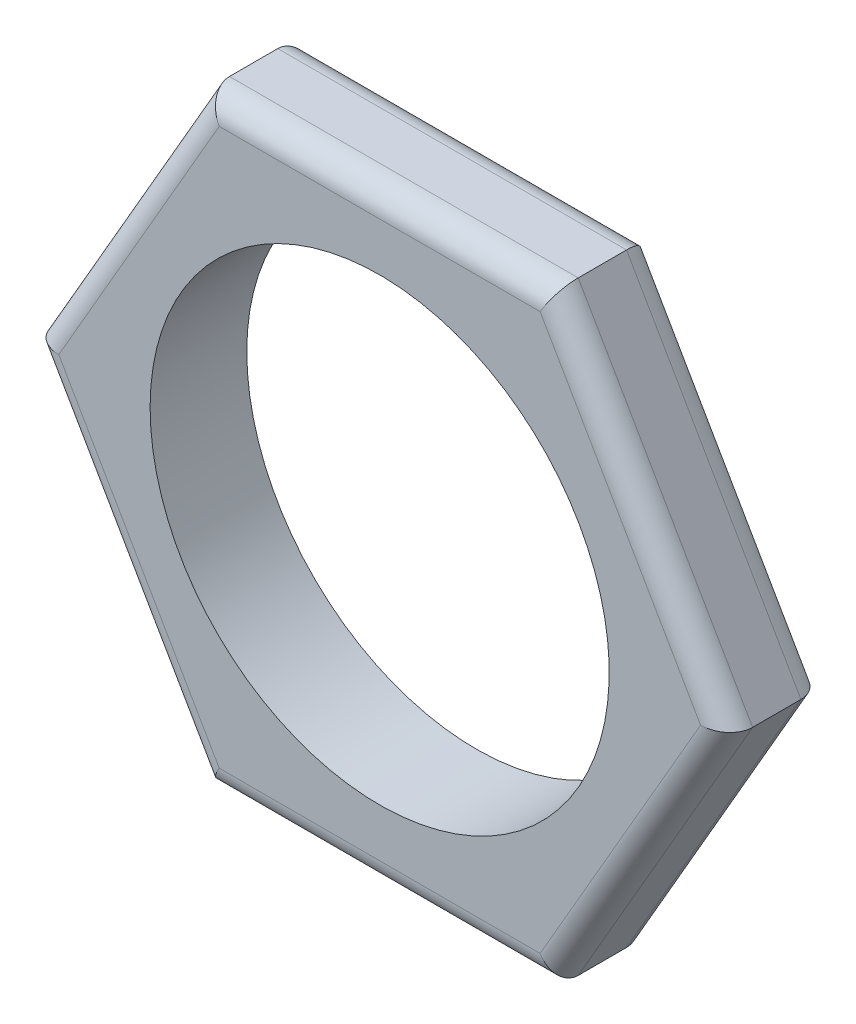
ISO-10303-21;
HEADER;
FILE_DESCRIPTION(('STEP AP214'),'2;1');
FILE_NAME('part.step','',(''),(''),'','','');
FILE_SCHEMA(('AUTOMOTIVE_DESIGN { 1 0 10303 214 1 1 1 1 }'));
ENDSEC;
DATA;
#1=APPLICATION_CONTEXT('core data for automotive mechanical design processes');
#2=APPLICATION_PROTOCOL_DEFINITION('international standard','automotive_design',2000,#1);
#3=PRODUCT_CONTEXT('',#1,'mechanical');
#4=PRODUCT('Part','Part','',(#3));
#5=PRODUCT_RELATED_PRODUCT_CATEGORY('part','',(#4));
#6=PRODUCT_DEFINITION_FORMATION('','',#4);
#7=PRODUCT_DEFINITION_CONTEXT('part definition',#1,'design');
#8=PRODUCT_DEFINITION('design','',#6,#7);
#9=PRODUCT_DEFINITION_SHAPE('','',#8);
#10=(LENGTH_UNIT() NAMED_UNIT(*) SI_UNIT(.MILLI.,.METRE.));
#11=(NAMED_UNIT(*) PLANE_ANGLE_UNIT() SI_UNIT($,.RADIAN.));
#12=(NAMED_UNIT(*) SI_UNIT($,.STERADIAN.) SOLID_ANGLE_UNIT());
#13=UNCERTAINTY_MEASURE_WITH_UNIT(LENGTH_MEASURE(1.E-05),#10,'distance_accuracy_value','');
#14=(GEOMETRIC_REPRESENTATION_CONTEXT(3) GLOBAL_UNCERTAINTY_ASSIGNED_CONTEXT((#13)) GLOBAL_UNIT_ASSIGNED_CONTEXT((#10,
#11,#12)) REPRESENTATION_CONTEXT('',''));
#15=CARTESIAN_POINT('',(0.,0.,0.));
#16=DIRECTION('',(0.,0.,1.));
#17=DIRECTION('',(1.,0.,0.));
#18=AXIS2_PLACEMENT_3D('',#15,#16,#17);
#19=CARTESIAN_POINT('',(-8.61550939198223,0.317499999999979,-0.635));
#20=DIRECTION('',(0.500000000000001,-0.866025403784438,0.));
#21=DIRECTION('',(0.866025403784438,0.500000000000001,0.));
#22=AXIS2_PLACEMENT_3D('',#19,#20,#21);
#23=CYLINDRICAL_SURFACE('',#22,0.635);
#24=CARTESIAN_POINT('',(-8.43220068151452,0.,-0.635));
#25=DIRECTION('',(0.,-1.,0.));
#26=DIRECTION('',(-1.,0.,0.));
#27=AXIS2_PLACEMENT_3D('',#24,#25,#26);
#28=ELLIPSE('',#27,0.733234841870825,0.635);
#29=CARTESIAN_POINT('',(-8.43220068151453,0.,-1.27));
#30=VERTEX_POINT('',#29);
#31=CARTESIAN_POINT('',(-9.16543552338535,0.,-0.635));
#32=VERTEX_POINT('',#31);
#33=EDGE_CURVE('E179',#30,#32,#28,.F.);
#34=ORIENTED_EDGE('',*,*,#33,.F.);
#35=DIRECTION('',(0.500000000000001,-0.866025403784438,0.));
#36=VECTOR('',#35,1.);
#37=CARTESIAN_POINT('',(-8.43220068151452,0.,-1.27));
#38=LINE('',#37,#36);
#39=CARTESIAN_POINT('',(-4.21610034075726,-7.30250000000004,-1.27));
#40=VERTEX_POINT('',#39);
#41=EDGE_CURVE('E107',#30,#40,#38,.T.);
#42=ORIENTED_EDGE('',*,*,#41,.T.);
#43=CARTESIAN_POINT('',(-4.21610034075726,-7.30250000000004,-0.635));
#44=DIRECTION('',(0.866025403784439,-0.499999999999999,0.));
#45=DIRECTION('',(0.499999999999999,0.866025403784439,0.));
#46=AXIS2_PLACEMENT_3D('',#43,#44,#45);
#47=ELLIPSE('',#46,0.733234841870825,0.635);
#48=CARTESIAN_POINT('',(-4.58271776169267,-7.93750000000004,-0.635));
#49=VERTEX_POINT('',#48);
#50=EDGE_CURVE('E19',#49,#40,#47,.T.);
#51=ORIENTED_EDGE('',*,*,#50,.F.);
#52=DIRECTION('',(-0.500000000000001,0.866025403784438,0.));
#53=VECTOR('',#52,1.);
#54=CARTESIAN_POINT('',(-9.16543552338535,0.,-0.635));
#55=LINE('',#54,#53);
#56=EDGE_CURVE('E104',#49,#32,#55,.T.);
#57=ORIENTED_EDGE('',*,*,#56,.T.);
#58=EDGE_LOOP('',(#34,#42,#51,#57));
#59=FACE_BOUND('',#58,.T.);
#60=ADVANCED_FACE('F16',(#59),#23,.T.);
#61=CARTESIAN_POINT('',(-4.58271776169267,-7.30250000000004,-0.635));
#62=DIRECTION('',(1.,0.,0.));
#63=DIRECTION('',(0.,0.,-1.));
#64=AXIS2_PLACEMENT_3D('',#61,#62,#63);
#65=CYLINDRICAL_SURFACE('',#64,0.635);
#66=CARTESIAN_POINT('',(4.21610034075723,-7.30250000000004,-0.635));
#67=DIRECTION('',(0.866025403784438,0.5,0.));
#68=DIRECTION('',(-0.5,0.866025403784438,0.));
#69=AXIS2_PLACEMENT_3D('',#66,#67,#68);
#70=ELLIPSE('',#69,0.733234841870825,0.635);
#71=CARTESIAN_POINT('',(4.58271776169264,-7.93750000000004,-0.635));
#72=VERTEX_POINT('',#71);
#73=CARTESIAN_POINT('',(4.21610034075723,-7.30250000000004,-1.27));
#74=VERTEX_POINT('',#73);
#75=EDGE_CURVE('E110',#72,#74,#70,.T.);
#76=ORIENTED_EDGE('',*,*,#75,.F.);
#77=DIRECTION('',(1.,0.,0.));
#78=VECTOR('',#77,1.);
#79=CARTESIAN_POINT('',(-4.58271776169267,-7.93750000000004,-0.635));
#80=LINE('',#79,#78);
#81=EDGE_CURVE('E112',#72,#49,#80,.F.);
#82=ORIENTED_EDGE('',*,*,#81,.T.);
#83=ORIENTED_EDGE('',*,*,#50,.T.);
#84=DIRECTION('',(1.,0.,0.));
#85=VECTOR('',#84,1.);
#86=CARTESIAN_POINT('',(0.,-7.30250000000004,-1.27));
#87=LINE('',#86,#85);
#88=EDGE_CURVE('E195',#40,#74,#87,.T.);
#89=ORIENTED_EDGE('',*,*,#88,.T.);
#90=EDGE_LOOP('',(#76,#82,#83,#89));
#91=FACE_BOUND('',#90,.T.);
#92=ADVANCED_FACE('F114',(#91),#65,.T.);
#93=CARTESIAN_POINT('',(4.03279163028952,-7.62000000000004,-0.635));
#94=DIRECTION('',(0.499999999999999,0.866025403784439,0.));
#95=DIRECTION('',(-0.866025403784439,0.499999999999999,0.));
#96=AXIS2_PLACEMENT_3D('',#93,#94,#95);
#97=CYLINDRICAL_SURFACE('',#96,0.635);
#98=CARTESIAN_POINT('',(8.43220068151448,0.,-0.635));
#99=DIRECTION('',(0.,1.,0.));
#100=DIRECTION('',(-1.,0.,0.));
#101=AXIS2_PLACEMENT_3D('',#98,#99,#100);
#102=ELLIPSE('',#101,0.733234841870824,0.635);
#103=CARTESIAN_POINT('',(9.16543552338531,0.,-0.635));
#104=VERTEX_POINT('',#103);
#105=CARTESIAN_POINT('',(8.43220068151448,0.,-1.27));
#106=VERTEX_POINT('',#105);
#107=EDGE_CURVE('E184',#104,#106,#102,.T.);
#108=ORIENTED_EDGE('',*,*,#107,.F.);
#109=DIRECTION('',(-0.499999999999999,-0.866025403784439,0.));
#110=VECTOR('',#109,1.);
#111=CARTESIAN_POINT('',(4.58271776169264,-7.93750000000004,-0.635));
#112=LINE('',#111,#110);
#113=EDGE_CURVE('E119',#104,#72,#112,.T.);
#114=ORIENTED_EDGE('',*,*,#113,.T.);
#115=ORIENTED_EDGE('',*,*,#75,.T.);
#116=DIRECTION('',(0.499999999999999,0.866025403784439,0.));
#117=VECTOR('',#116,1.);
#118=CARTESIAN_POINT('',(4.21610034075723,-7.30250000000004,-1.27));
#119=LINE('',#118,#117);
#120=EDGE_CURVE('E189',#74,#106,#119,.T.);
#121=ORIENTED_EDGE('',*,*,#120,.T.);
#122=EDGE_LOOP('',(#108,#114,#115,#121));
#123=FACE_BOUND('',#122,.T.);
#124=ADVANCED_FACE('F188',(#123),#97,.T.);
#125=CARTESIAN_POINT('',(8.61550939198219,-0.3175,-0.635));
#126=DIRECTION('',(-0.499999999999999,0.866025403784439,0.));
#127=DIRECTION('',(-0.866025403784439,-0.499999999999999,0.));
#128=AXIS2_PLACEMENT_3D('',#125,#126,#127);
#129=CYLINDRICAL_SURFACE('',#128,0.635);
#130=CARTESIAN_POINT('',(4.21610034075723,7.30250000000003,-0.635));
#131=DIRECTION('',(-0.866025403784438,0.5,0.));
#132=DIRECTION('',(-0.5,-0.866025403784438,0.));
#133=AXIS2_PLACEMENT_3D('',#130,#131,#132);
#134=ELLIPSE('',#133,0.733234841870825,0.635);
#135=CARTESIAN_POINT('',(4.58271776169264,7.93750000000003,-0.635));
#136=VERTEX_POINT('',#135);
#137=CARTESIAN_POINT('',(4.21610034075723,7.30250000000003,-1.27));
#138=VERTEX_POINT('',#137);
#139=EDGE_CURVE('E181',#136,#138,#134,.T.);
#140=ORIENTED_EDGE('',*,*,#139,.F.);
#141=DIRECTION('',(0.499999999999999,-0.866025403784439,0.));
#142=VECTOR('',#141,1.);
#143=CARTESIAN_POINT('',(9.16543552338531,0.,-0.635));
#144=LINE('',#143,#142);
#145=EDGE_CURVE('E147',#136,#104,#144,.T.);
#146=ORIENTED_EDGE('',*,*,#145,.T.);
#147=ORIENTED_EDGE('',*,*,#107,.T.);
#148=DIRECTION('',(-0.5,0.866025403784439,0.));
#149=VECTOR('',#148,1.);
#150=CARTESIAN_POINT('',(8.43220068151448,0.,-1.27));
#151=LINE('',#150,#149);
#152=EDGE_CURVE('E196',#106,#138,#151,.T.);
#153=ORIENTED_EDGE('',*,*,#152,.T.);
#154=EDGE_LOOP('',(#140,#146,#147,#153));
#155=FACE_BOUND('',#154,.T.);
#156=ADVANCED_FACE('F268',(#155),#129,.T.);
#157=CARTESIAN_POINT('',(4.58271776169264,7.30250000000003,-0.635));
#158=DIRECTION('',(-1.,0.,0.));
#159=DIRECTION('',(0.,0.,1.));
#160=AXIS2_PLACEMENT_3D('',#157,#158,#159);
#161=CYLINDRICAL_SURFACE('',#160,0.635);
#162=CARTESIAN_POINT('',(-4.21610034075725,7.30250000000003,-0.635));
#163=DIRECTION('',(-0.866025403784439,-0.5,0.));
#164=DIRECTION('',(0.5,-0.866025403784439,0.));
#165=AXIS2_PLACEMENT_3D('',#162,#163,#164);
#166=ELLIPSE('',#165,0.733234841870825,0.635);
#167=CARTESIAN_POINT('',(-4.58271776169266,7.93750000000003,-0.635));
#168=VERTEX_POINT('',#167);
#169=CARTESIAN_POINT('',(-4.21610034075725,7.30250000000003,-1.27));
#170=VERTEX_POINT('',#169);
#171=EDGE_CURVE('E120',#168,#170,#166,.T.);
#172=ORIENTED_EDGE('',*,*,#171,.F.);
#173=DIRECTION('',(1.,0.,0.));
#174=VECTOR('',#173,1.);
#175=CARTESIAN_POINT('',(4.58271776169264,7.93750000000003,-0.635));
#176=LINE('',#175,#174);
#177=EDGE_CURVE('E142',#168,#136,#176,.T.);
#178=ORIENTED_EDGE('',*,*,#177,.T.);
#179=ORIENTED_EDGE('',*,*,#139,.T.);
#180=DIRECTION('',(1.,0.,0.));
#181=VECTOR('',#180,1.);
#182=CARTESIAN_POINT('',(0.,7.30250000000003,-1.27));
#183=LINE('',#182,#181);
#184=EDGE_CURVE('E198',#138,#170,#183,.F.);
#185=ORIENTED_EDGE('',*,*,#184,.T.);
#186=EDGE_LOOP('',(#172,#178,#179,#185));
#187=FACE_BOUND('',#186,.T.);
#188=ADVANCED_FACE('F262',(#187),#161,.T.);
#189=CARTESIAN_POINT('',(-4.03279163028954,7.62000000000003,-0.635));
#190=DIRECTION('',(-0.5,-0.866025403784439,0.));
#191=DIRECTION('',(0.866025403784439,-0.5,0.));
#192=AXIS2_PLACEMENT_3D('',#189,#190,#191);
#193=CYLINDRICAL_SURFACE('',#192,0.635);
#194=ORIENTED_EDGE('',*,*,#171,.T.);
#195=DIRECTION('',(-0.5,-0.866025403784439,0.));
#196=VECTOR('',#195,1.);
#197=CARTESIAN_POINT('',(-4.21610034075725,7.30250000000003,-1.27));
#198=LINE('',#197,#196);
#199=EDGE_CURVE('E202',#170,#30,#198,.T.);
#200=ORIENTED_EDGE('',*,*,#199,.T.);
#201=ORIENTED_EDGE('',*,*,#33,.T.);
#202=DIRECTION('',(0.5,0.866025403784439,0.));
#203=VECTOR('',#202,1.);
#204=CARTESIAN_POINT('',(-4.58271776169266,7.93750000000003,-0.635));
#205=LINE('',#204,#203);
#206=EDGE_CURVE('E139',#32,#168,#205,.T.);
#207=ORIENTED_EDGE('',*,*,#206,.T.);
#208=EDGE_LOOP('',(#194,#200,#201,#207));
#209=FACE_BOUND('',#208,.T.);
#210=ADVANCED_FACE('F257',(#209),#193,.T.);
#211=CARTESIAN_POINT('',(-4.58271776169267,-7.93750000000004,1.27));
#212=DIRECTION('',(0.,1.,0.));
#213=DIRECTION('',(0.,0.,1.));
#214=AXIS2_PLACEMENT_3D('',#211,#212,#213);
#215=PLANE('',#214);
#216=ORIENTED_EDGE('',*,*,#81,.F.);
#217=DIRECTION('',(0.,0.,1.));
#218=VECTOR('',#217,1.);
#219=CARTESIAN_POINT('',(4.58271776169264,-7.93750000000004,1.27));
#220=LINE('',#219,#218);
#221=CARTESIAN_POINT('',(4.58271776169264,-7.93750000000004,0.635));
#222=VERTEX_POINT('',#221);
#223=EDGE_CURVE('E150',#72,#222,#220,.T.);
#224=ORIENTED_EDGE('',*,*,#223,.T.);
#225=DIRECTION('',(-1.,0.,0.));
#226=VECTOR('',#225,1.);
#227=CARTESIAN_POINT('',(0.,-7.93750000000004,0.635));
#228=LINE('',#227,#226);
#229=CARTESIAN_POINT('',(-4.58271776169267,-7.93750000000004,0.635));
#230=VERTEX_POINT('',#229);
#231=EDGE_CURVE('E127',#230,#222,#228,.F.);
#232=ORIENTED_EDGE('',*,*,#231,.F.);
#233=DIRECTION('',(0.,0.,1.));
#234=VECTOR('',#233,1.);
#235=CARTESIAN_POINT('',(-4.58271776169267,-7.93750000000004,1.27));
#236=LINE('',#235,#234);
#237=EDGE_CURVE('E124',#230,#49,#236,.F.);
#238=ORIENTED_EDGE('',*,*,#237,.T.);
#239=EDGE_LOOP('',(#216,#224,#232,#238));
#240=FACE_BOUND('',#239,.T.);
#241=ADVANCED_FACE('F125',(#240),#215,.F.);
#242=CARTESIAN_POINT('',(4.58271776169264,-7.93750000000004,1.27));
#243=DIRECTION('',(-0.866025403784439,0.499999999999999,0.));
#244=DIRECTION('',(-0.499999999999999,-0.866025403784439,0.));
#245=AXIS2_PLACEMENT_3D('',#242,#243,#244);
#246=PLANE('',#245);
#247=ORIENTED_EDGE('',*,*,#113,.F.);
#248=DIRECTION('',(0.,0.,1.));
#249=VECTOR('',#248,1.);
#250=CARTESIAN_POINT('',(9.16543552338531,0.,1.27));
#251=LINE('',#250,#249);
#252=CARTESIAN_POINT('',(9.16543552338531,0.,0.635));
#253=VERTEX_POINT('',#252);
#254=EDGE_CURVE('E146',#104,#253,#251,.T.);
#255=ORIENTED_EDGE('',*,*,#254,.T.);
#256=DIRECTION('',(-0.499999999999999,-0.866025403784439,0.));
#257=VECTOR('',#256,1.);
#258=CARTESIAN_POINT('',(6.87407664253899,-3.96874999999999,0.635));
#259=LINE('',#258,#257);
#260=EDGE_CURVE('E173',#222,#253,#259,.F.);
#261=ORIENTED_EDGE('',*,*,#260,.F.);
#262=ORIENTED_EDGE('',*,*,#223,.F.);
#263=EDGE_LOOP('',(#247,#255,#261,#262));
#264=FACE_BOUND('',#263,.T.);
#265=ADVANCED_FACE('F270',(#264),#246,.F.);
#266=CARTESIAN_POINT('',(9.16543552338531,0.,1.27));
#267=DIRECTION('',(-0.866025403784439,-0.499999999999999,0.));
#268=DIRECTION('',(0.499999999999999,-0.866025403784439,0.));
#269=AXIS2_PLACEMENT_3D('',#266,#267,#268);
#270=PLANE('',#269);
#271=ORIENTED_EDGE('',*,*,#145,.F.);
#272=DIRECTION('',(0.,0.,-1.));
#273=VECTOR('',#272,1.);
#274=CARTESIAN_POINT('',(4.58271776169264,7.93750000000003,1.27));
#275=LINE('',#274,#273);
#276=CARTESIAN_POINT('',(4.58271776169264,7.93750000000003,0.635));
#277=VERTEX_POINT('',#276);
#278=EDGE_CURVE('E145',#136,#277,#275,.F.);
#279=ORIENTED_EDGE('',*,*,#278,.T.);
#280=DIRECTION('',(0.499999999999999,-0.866025403784439,0.));
#281=VECTOR('',#280,1.);
#282=CARTESIAN_POINT('',(6.87407664253899,3.96875,0.635));
#283=LINE('',#282,#281);
#284=EDGE_CURVE('E169',#253,#277,#283,.F.);
#285=ORIENTED_EDGE('',*,*,#284,.F.);
#286=ORIENTED_EDGE('',*,*,#254,.F.);
#287=EDGE_LOOP('',(#271,#279,#285,#286));
#288=FACE_BOUND('',#287,.T.);
#289=ADVANCED_FACE('F265',(#288),#270,.F.);
#290=CARTESIAN_POINT('',(4.58271776169264,7.93750000000003,1.27));
#291=DIRECTION('',(0.,-1.,0.));
#292=DIRECTION('',(0.,0.,-1.));
#293=AXIS2_PLACEMENT_3D('',#290,#291,#292);
#294=PLANE('',#293);
#295=ORIENTED_EDGE('',*,*,#177,.F.);
#296=DIRECTION('',(0.,0.,1.));
#297=VECTOR('',#296,1.);
#298=CARTESIAN_POINT('',(-4.58271776169266,7.93750000000003,1.27));
#299=LINE('',#298,#297);
#300=CARTESIAN_POINT('',(-4.58271776169266,7.93750000000003,0.635));
#301=VERTEX_POINT('',#300);
#302=EDGE_CURVE('E131',#168,#301,#299,.T.);
#303=ORIENTED_EDGE('',*,*,#302,.T.);
#304=DIRECTION('',(1.,0.,0.));
#305=VECTOR('',#304,1.);
#306=CARTESIAN_POINT('',(0.,7.93750000000003,0.635));
#307=LINE('',#306,#305);
#308=EDGE_CURVE('E165',#277,#301,#307,.F.);
#309=ORIENTED_EDGE('',*,*,#308,.F.);
#310=ORIENTED_EDGE('',*,*,#278,.F.);
#311=EDGE_LOOP('',(#295,#303,#309,#310));
#312=FACE_BOUND('',#311,.T.);
#313=ADVANCED_FACE('F259',(#312),#294,.F.);
#314=CARTESIAN_POINT('',(-4.58271776169266,7.93750000000003,1.27));
#315=DIRECTION('',(0.866025403784439,-0.5,0.));
#316=DIRECTION('',(0.5,0.866025403784439,0.));
#317=AXIS2_PLACEMENT_3D('',#314,#315,#316);
#318=PLANE('',#317);
#319=ORIENTED_EDGE('',*,*,#206,.F.);
#320=DIRECTION('',(0.,0.,1.));
#321=VECTOR('',#320,1.);
#322=CARTESIAN_POINT('',(-9.16543552338535,0.,1.27));
#323=LINE('',#322,#321);
#324=CARTESIAN_POINT('',(-9.16543552338535,0.,0.635));
#325=VERTEX_POINT('',#324);
#326=EDGE_CURVE('E135',#32,#325,#323,.T.);
#327=ORIENTED_EDGE('',*,*,#326,.T.);
#328=DIRECTION('',(0.5,0.866025403784439,0.));
#329=VECTOR('',#328,1.);
#330=CARTESIAN_POINT('',(-6.874076642539,3.96875000000001,0.635));
#331=LINE('',#330,#329);
#332=EDGE_CURVE('E161',#301,#325,#331,.F.);
#333=ORIENTED_EDGE('',*,*,#332,.F.);
#334=ORIENTED_EDGE('',*,*,#302,.F.);
#335=EDGE_LOOP('',(#319,#327,#333,#334));
#336=FACE_BOUND('',#335,.T.);
#337=ADVANCED_FACE('F253',(#336),#318,.F.);
#338=CARTESIAN_POINT('',(-9.16543552338535,0.,1.27));
#339=DIRECTION('',(0.866025403784438,0.500000000000001,0.));
#340=DIRECTION('',(-0.500000000000001,0.866025403784438,0.));
#341=AXIS2_PLACEMENT_3D('',#338,#339,#340);
#342=PLANE('',#341);
#343=ORIENTED_EDGE('',*,*,#56,.F.);
#344=ORIENTED_EDGE('',*,*,#237,.F.);
#345=DIRECTION('',(-0.500000000000001,0.866025403784438,0.));
#346=VECTOR('',#345,1.);
#347=CARTESIAN_POINT('',(-6.87407664253901,-3.96875000000003,0.635));
#348=LINE('',#347,#346);
#349=EDGE_CURVE('E159',#325,#230,#348,.F.);
#350=ORIENTED_EDGE('',*,*,#349,.F.);
#351=ORIENTED_EDGE('',*,*,#326,.F.);
#352=EDGE_LOOP('',(#343,#344,#350,#351));
#353=FACE_BOUND('',#352,.T.);
#354=ADVANCED_FACE('F134',(#353),#342,.F.);
#355=CARTESIAN_POINT('',(0.,0.,-1.27));
#356=DIRECTION('',(0.,0.,1.));
#357=DIRECTION('',(1.,0.,0.));
#358=AXIS2_PLACEMENT_3D('',#355,#356,#357);
#359=PLANE('',#358);
#360=CARTESIAN_POINT('',(0.,0.,-1.27));
#361=DIRECTION('',(0.,0.,-1.));
#362=DIRECTION('',(-1.,0.,0.));
#363=AXIS2_PLACEMENT_3D('',#360,#361,#362);
#364=CIRCLE('',#363,6.0325);
#365=CARTESIAN_POINT('',(-6.0325,0.,-1.27));
#366=VERTEX_POINT('',#365);
#367=EDGE_CURVE('E152',#366,#366,#364,.F.);
#368=ORIENTED_EDGE('',*,*,#367,.T.);
#369=EDGE_LOOP('',(#368));
#370=FACE_BOUND('',#369,.T.);
#371=ORIENTED_EDGE('',*,*,#184,.F.);
#372=ORIENTED_EDGE('',*,*,#152,.F.);
#373=ORIENTED_EDGE('',*,*,#120,.F.);
#374=ORIENTED_EDGE('',*,*,#88,.F.);
#375=ORIENTED_EDGE('',*,*,#41,.F.);
#376=ORIENTED_EDGE('',*,*,#199,.F.);
#377=EDGE_LOOP('',(#371,#372,#373,#374,#375,#376));
#378=FACE_BOUND('',#377,.T.);
#379=ADVANCED_FACE('F194',(#370,#378),#359,.F.);
#380=CARTESIAN_POINT('',(0.,-7.30250000000004,0.635));
#381=DIRECTION('',(-1.,0.,0.));
#382=DIRECTION('',(0.,0.,1.));
#383=AXIS2_PLACEMENT_3D('',#380,#381,#382);
#384=CYLINDRICAL_SURFACE('',#383,0.635);
#385=CARTESIAN_POINT('',(4.21610034075723,-7.30250000000004,0.635));
#386=DIRECTION('',(-0.866025403784438,-0.5,0.));
#387=DIRECTION('',(0.5,-0.866025403784438,0.));
#388=AXIS2_PLACEMENT_3D('',#385,#386,#387);
#389=ELLIPSE('',#388,0.733234841870825,0.635);
#390=CARTESIAN_POINT('',(4.21610034075723,-7.30250000000004,1.27));
#391=VERTEX_POINT('',#390);
#392=EDGE_CURVE('E174',#391,#222,#389,.F.);
#393=ORIENTED_EDGE('',*,*,#392,.F.);
#394=DIRECTION('',(1.,0.,0.));
#395=VECTOR('',#394,1.);
#396=CARTESIAN_POINT('',(0.,-7.30250000000004,1.27));
#397=LINE('',#396,#395);
#398=CARTESIAN_POINT('',(-4.21610034075726,-7.30250000000004,1.27));
#399=VERTEX_POINT('',#398);
#400=EDGE_CURVE('E155',#399,#391,#397,.T.);
#401=ORIENTED_EDGE('',*,*,#400,.F.);
#402=CARTESIAN_POINT('',(-4.21610034075726,-7.30250000000004,0.635));
#403=DIRECTION('',(-0.866025403784439,0.499999999999999,0.));
#404=DIRECTION('',(0.499999999999999,0.866025403784439,0.));
#405=AXIS2_PLACEMENT_3D('',#402,#403,#404);
#406=ELLIPSE('',#405,0.733234841870825,0.635);
#407=EDGE_CURVE('E156',#230,#399,#406,.T.);
#408=ORIENTED_EDGE('',*,*,#407,.F.);
#409=ORIENTED_EDGE('',*,*,#231,.T.);
#410=EDGE_LOOP('',(#393,#401,#408,#409));
#411=FACE_BOUND('',#410,.T.);
#412=ADVANCED_FACE('F239',(#411),#384,.T.);
#413=CARTESIAN_POINT('',(6.32415051113587,-3.65124999999999,0.635));
#414=DIRECTION('',(-0.499999999999999,-0.866025403784439,0.));
#415=DIRECTION('',(0.866025403784439,-0.499999999999999,0.));
#416=AXIS2_PLACEMENT_3D('',#413,#414,#415);
#417=CYLINDRICAL_SURFACE('',#416,0.635);
#418=CARTESIAN_POINT('',(8.43220068151448,0.,0.635));
#419=DIRECTION('',(0.,-1.,0.));
#420=DIRECTION('',(1.,0.,0.));
#421=AXIS2_PLACEMENT_3D('',#418,#419,#420);
#422=ELLIPSE('',#421,0.733234841870824,0.635);
#423=CARTESIAN_POINT('',(8.43220068151448,0.,1.27));
#424=VERTEX_POINT('',#423);
#425=EDGE_CURVE('E170',#424,#253,#422,.F.);
#426=ORIENTED_EDGE('',*,*,#425,.F.);
#427=DIRECTION('',(0.499999999999999,0.866025403784439,0.));
#428=VECTOR('',#427,1.);
#429=CARTESIAN_POINT('',(4.21610034075723,-7.30250000000004,1.27));
#430=LINE('',#429,#428);
#431=EDGE_CURVE('E213',#391,#424,#430,.T.);
#432=ORIENTED_EDGE('',*,*,#431,.F.);
#433=ORIENTED_EDGE('',*,*,#392,.T.);
#434=ORIENTED_EDGE('',*,*,#260,.T.);
#435=EDGE_LOOP('',(#426,#432,#433,#434));
#436=FACE_BOUND('',#435,.T.);
#437=ADVANCED_FACE('F273',(#436),#417,.T.);
#438=CARTESIAN_POINT('',(6.32415051113587,3.65125,0.635));
#439=DIRECTION('',(0.499999999999999,-0.866025403784439,0.));
#440=DIRECTION('',(0.866025403784439,0.499999999999999,0.));
#441=AXIS2_PLACEMENT_3D('',#438,#439,#440);
#442=CYLINDRICAL_SURFACE('',#441,0.635);
#443=ORIENTED_EDGE('',*,*,#425,.T.);
#444=ORIENTED_EDGE('',*,*,#284,.T.);
#445=CARTESIAN_POINT('',(4.21610034075723,7.30250000000003,0.635));
#446=DIRECTION('',(0.866025403784438,-0.5,0.));
#447=DIRECTION('',(0.5,0.866025403784438,0.));
#448=AXIS2_PLACEMENT_3D('',#445,#446,#447);
#449=ELLIPSE('',#448,0.733234841870825,0.635);
#450=CARTESIAN_POINT('',(4.21610034075723,7.30250000000004,1.27));
#451=VERTEX_POINT('',#450);
#452=EDGE_CURVE('E166',#451,#277,#449,.F.);
#453=ORIENTED_EDGE('',*,*,#452,.F.);
#454=DIRECTION('',(-0.499999999999999,0.866025403784439,0.));
#455=VECTOR('',#454,1.);
#456=CARTESIAN_POINT('',(8.43220068151448,0.,1.27));
#457=LINE('',#456,#455);
#458=EDGE_CURVE('E216',#424,#451,#457,.T.);
#459=ORIENTED_EDGE('',*,*,#458,.F.);
#460=EDGE_LOOP('',(#443,#444,#453,#459));
#461=FACE_BOUND('',#460,.T.);
#462=ADVANCED_FACE('F276',(#461),#442,.T.);
#463=CARTESIAN_POINT('',(0.,7.30250000000003,0.635));
#464=DIRECTION('',(1.,0.,0.));
#465=DIRECTION('',(0.,0.,-1.));
#466=AXIS2_PLACEMENT_3D('',#463,#464,#465);
#467=CYLINDRICAL_SURFACE('',#466,0.635);
#468=ORIENTED_EDGE('',*,*,#452,.T.);
#469=ORIENTED_EDGE('',*,*,#308,.T.);
#470=CARTESIAN_POINT('',(-4.21610034075725,7.30250000000003,0.635));
#471=DIRECTION('',(0.866025403784439,0.5,0.));
#472=DIRECTION('',(-0.5,0.866025403784439,0.));
#473=AXIS2_PLACEMENT_3D('',#470,#471,#472);
#474=ELLIPSE('',#473,0.733234841870825,0.635);
#475=CARTESIAN_POINT('',(-4.21610034075725,7.30250000000003,1.27));
#476=VERTEX_POINT('',#475);
#477=EDGE_CURVE('E162',#476,#301,#474,.F.);
#478=ORIENTED_EDGE('',*,*,#477,.F.);
#479=DIRECTION('',(1.,0.,0.));
#480=VECTOR('',#479,1.);
#481=CARTESIAN_POINT('',(0.,7.30250000000003,1.27));
#482=LINE('',#481,#480);
#483=EDGE_CURVE('E221',#451,#476,#482,.F.);
#484=ORIENTED_EDGE('',*,*,#483,.F.);
#485=EDGE_LOOP('',(#468,#469,#478,#484));
#486=FACE_BOUND('',#485,.T.);
#487=ADVANCED_FACE('F247',(#486),#467,.T.);
#488=CARTESIAN_POINT('',(-6.32415051113588,3.65125000000001,0.635));
#489=DIRECTION('',(0.5,0.866025403784439,0.));
#490=DIRECTION('',(-0.866025403784439,0.5,0.));
#491=AXIS2_PLACEMENT_3D('',#488,#489,#490);
#492=CYLINDRICAL_SURFACE('',#491,0.635);
#493=CARTESIAN_POINT('',(-8.43220068151452,0.,0.635));
#494=DIRECTION('',(0.,1.,0.));
#495=DIRECTION('',(-1.,0.,0.));
#496=AXIS2_PLACEMENT_3D('',#493,#494,#495);
#497=ELLIPSE('',#496,0.733234841870825,0.635);
#498=CARTESIAN_POINT('',(-8.43220068151452,0.,1.27));
#499=VERTEX_POINT('',#498);
#500=EDGE_CURVE('E34',#499,#325,#497,.F.);
#501=ORIENTED_EDGE('',*,*,#500,.F.);
#502=DIRECTION('',(-0.5,-0.866025403784438,0.));
#503=VECTOR('',#502,1.);
#504=CARTESIAN_POINT('',(-4.21610034075725,7.30250000000003,1.27));
#505=LINE('',#504,#503);
#506=EDGE_CURVE('E226',#476,#499,#505,.T.);
#507=ORIENTED_EDGE('',*,*,#506,.F.);
#508=ORIENTED_EDGE('',*,*,#477,.T.);
#509=ORIENTED_EDGE('',*,*,#332,.T.);
#510=EDGE_LOOP('',(#501,#507,#508,#509));
#511=FACE_BOUND('',#510,.T.);
#512=ADVANCED_FACE('F244',(#511),#492,.T.);
#513=CARTESIAN_POINT('',(-6.32415051113589,-3.65125000000003,0.635));
#514=DIRECTION('',(-0.500000000000001,0.866025403784438,0.));
#515=DIRECTION('',(-0.866025403784438,-0.500000000000001,0.));
#516=AXIS2_PLACEMENT_3D('',#513,#514,#515);
#517=CYLINDRICAL_SURFACE('',#516,0.635);
#518=ORIENTED_EDGE('',*,*,#407,.T.);
#519=DIRECTION('',(0.500000000000001,-0.866025403784438,0.));
#520=VECTOR('',#519,1.);
#521=CARTESIAN_POINT('',(-8.43220068151452,0.,1.27));
#522=LINE('',#521,#520);
#523=EDGE_CURVE('E25',#499,#399,#522,.T.);
#524=ORIENTED_EDGE('',*,*,#523,.F.);
#525=ORIENTED_EDGE('',*,*,#500,.T.);
#526=ORIENTED_EDGE('',*,*,#349,.T.);
#527=EDGE_LOOP('',(#518,#524,#525,#526));
#528=FACE_BOUND('',#527,.T.);
#529=ADVANCED_FACE('F236',(#528),#517,.T.);
#530=CARTESIAN_POINT('',(0.,0.,1.27));
#531=DIRECTION('',(0.,0.,-1.));
#532=DIRECTION('',(-1.,0.,0.));
#533=AXIS2_PLACEMENT_3D('',#530,#531,#532);
#534=CYLINDRICAL_SURFACE('',#533,6.0325);
#535=CARTESIAN_POINT('',(0.,0.,1.27));
#536=DIRECTION('',(0.,0.,-1.));
#537=DIRECTION('',(-1.,0.,0.));
#538=AXIS2_PLACEMENT_3D('',#535,#536,#537);
#539=CIRCLE('',#538,6.0325);
#540=CARTESIAN_POINT('',(-6.0325,0.,1.27));
#541=VERTEX_POINT('',#540);
#542=EDGE_CURVE('E11',#541,#541,#539,.T.);
#543=ORIENTED_EDGE('',*,*,#542,.F.);
#544=EDGE_LOOP('',(#543));
#545=FACE_BOUND('',#544,.T.);
#546=ORIENTED_EDGE('',*,*,#367,.F.);
#547=EDGE_LOOP('',(#546));
#548=FACE_BOUND('',#547,.T.);
#549=ADVANCED_FACE('F287',(#545,#548),#534,.F.);
#550=CARTESIAN_POINT('',(0.,0.,1.27));
#551=DIRECTION('',(0.,0.,1.));
#552=DIRECTION('',(1.,0.,0.));
#553=AXIS2_PLACEMENT_3D('',#550,#551,#552);
#554=PLANE('',#553);
#555=ORIENTED_EDGE('',*,*,#542,.T.);
#556=EDGE_LOOP('',(#555));
#557=FACE_BOUND('',#556,.T.);
#558=ORIENTED_EDGE('',*,*,#506,.T.);
#559=ORIENTED_EDGE('',*,*,#523,.T.);
#560=ORIENTED_EDGE('',*,*,#400,.T.);
#561=ORIENTED_EDGE('',*,*,#431,.T.);
#562=ORIENTED_EDGE('',*,*,#458,.T.);
#563=ORIENTED_EDGE('',*,*,#483,.T.);
#564=EDGE_LOOP('',(#558,#559,#560,#561,#562,#563));
#565=FACE_BOUND('',#564,.T.);
#566=ADVANCED_FACE('F242',(#557,#565),#554,.T.);
#567=CLOSED_SHELL('',(#60,#92,#124,#156,#188,#210,#241,#265,#289,#313,#337,#354,#379,#412,#437,
#462,#487,#512,#529,#549,#566));
#568=MANIFOLD_SOLID_BREP('B1',#567);
#569=ADVANCED_BREP_SHAPE_REPRESENTATION('',(#18,#568),#14);
#570=SHAPE_DEFINITION_REPRESENTATION(#9,#569);
ENDSEC;
END-ISO-10303-21;
